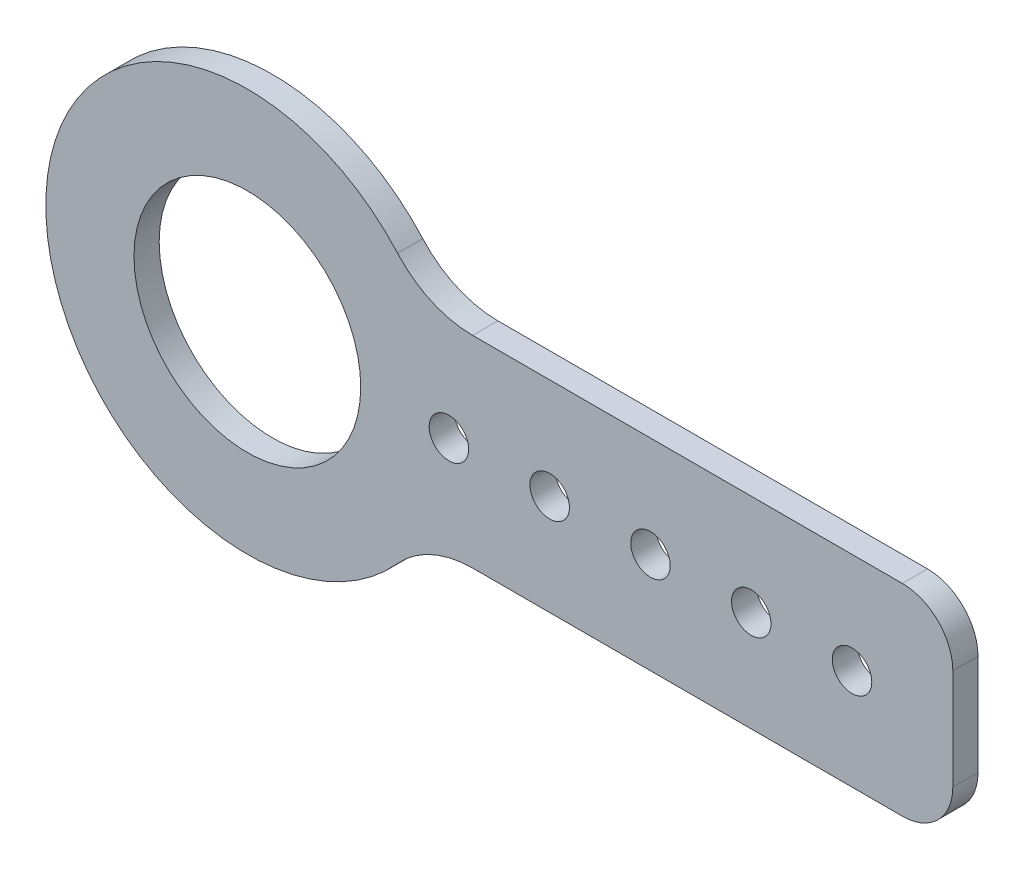
ISO-10303-21;
HEADER;
FILE_DESCRIPTION(('STEP AP214'),'2;1');
FILE_NAME('part.step','',(''),(''),'','','');
FILE_SCHEMA(('AUTOMOTIVE_DESIGN { 1 0 10303 214 1 1 1 1 }'));
ENDSEC;
DATA;
#1=APPLICATION_CONTEXT('core data for automotive mechanical design processes');
#2=APPLICATION_PROTOCOL_DEFINITION('international standard','automotive_design',2000,#1);
#3=PRODUCT_CONTEXT('',#1,'mechanical');
#4=PRODUCT('Part','Part','',(#3));
#5=PRODUCT_RELATED_PRODUCT_CATEGORY('part','',(#4));
#6=PRODUCT_DEFINITION_FORMATION('','',#4);
#7=PRODUCT_DEFINITION_CONTEXT('part definition',#1,'design');
#8=PRODUCT_DEFINITION('design','',#6,#7);
#9=PRODUCT_DEFINITION_SHAPE('','',#8);
#10=(LENGTH_UNIT() NAMED_UNIT(*) SI_UNIT(.MILLI.,.METRE.));
#11=(NAMED_UNIT(*) PLANE_ANGLE_UNIT() SI_UNIT($,.RADIAN.));
#12=(NAMED_UNIT(*) SI_UNIT($,.STERADIAN.) SOLID_ANGLE_UNIT());
#13=UNCERTAINTY_MEASURE_WITH_UNIT(LENGTH_MEASURE(1.E-05),#10,'distance_accuracy_value','');
#14=(GEOMETRIC_REPRESENTATION_CONTEXT(3) GLOBAL_UNCERTAINTY_ASSIGNED_CONTEXT((#13)) GLOBAL_UNIT_ASSIGNED_CONTEXT((#10,
#11,#12)) REPRESENTATION_CONTEXT('',''));
#15=CARTESIAN_POINT('',(0.,0.,0.));
#16=DIRECTION('',(0.,0.,1.));
#17=DIRECTION('',(1.,0.,0.));
#18=AXIS2_PLACEMENT_3D('',#15,#16,#17);
#19=CARTESIAN_POINT('',(56.7177514109584,0.,0.));
#20=DIRECTION('',(0.,0.,1.));
#21=DIRECTION('',(1.,0.,0.));
#22=AXIS2_PLACEMENT_3D('',#19,#20,#21);
#23=PLANE('',#22);
#24=CARTESIAN_POINT('',(0.,0.,0.));
#25=DIRECTION('',(0.,0.,1.));
#26=DIRECTION('',(1.,0.,0.));
#27=AXIS2_PLACEMENT_3D('',#24,#25,#26);
#28=CIRCLE('',#27,14.2875);
#29=CARTESIAN_POINT('',(14.2875,0.,0.));
#30=VERTEX_POINT('',#29);
#31=EDGE_CURVE('E142',#30,#30,#28,.T.);
#32=ORIENTED_EDGE('',*,*,#31,.T.);
#33=EDGE_LOOP('',(#32));
#34=FACE_BOUND('',#33,.T.);
#35=CARTESIAN_POINT('',(25.4,0.,0.));
#36=DIRECTION('',(0.,0.,1.));
#37=DIRECTION('',(1.,0.,0.));
#38=AXIS2_PLACEMENT_3D('',#35,#36,#37);
#39=CIRCLE('',#38,2.4892);
#40=CARTESIAN_POINT('',(27.8892,0.,0.));
#41=VERTEX_POINT('',#40);
#42=EDGE_CURVE('E145',#41,#41,#39,.T.);
#43=ORIENTED_EDGE('',*,*,#42,.T.);
#44=EDGE_LOOP('',(#43));
#45=FACE_BOUND('',#44,.T.);
#46=CARTESIAN_POINT('',(63.5,0.,0.));
#47=DIRECTION('',(0.,0.,1.));
#48=DIRECTION('',(1.,0.,0.));
#49=AXIS2_PLACEMENT_3D('',#46,#47,#48);
#50=CIRCLE('',#49,2.4892);
#51=CARTESIAN_POINT('',(65.9892,0.,0.));
#52=VERTEX_POINT('',#51);
#53=EDGE_CURVE('E148',#52,#52,#50,.T.);
#54=ORIENTED_EDGE('',*,*,#53,.T.);
#55=EDGE_LOOP('',(#54));
#56=FACE_BOUND('',#55,.T.);
#57=CARTESIAN_POINT('',(38.1,0.,0.));
#58=DIRECTION('',(0.,0.,1.));
#59=DIRECTION('',(1.,0.,0.));
#60=AXIS2_PLACEMENT_3D('',#57,#58,#59);
#61=CIRCLE('',#60,2.4892);
#62=CARTESIAN_POINT('',(40.5892,0.,0.));
#63=VERTEX_POINT('',#62);
#64=EDGE_CURVE('E151',#63,#63,#61,.T.);
#65=ORIENTED_EDGE('',*,*,#64,.T.);
#66=EDGE_LOOP('',(#65));
#67=FACE_BOUND('',#66,.T.);
#68=CARTESIAN_POINT('',(50.8,0.,0.));
#69=DIRECTION('',(0.,0.,1.));
#70=DIRECTION('',(1.,0.,0.));
#71=AXIS2_PLACEMENT_3D('',#68,#69,#70);
#72=CIRCLE('',#71,2.4892);
#73=CARTESIAN_POINT('',(53.2892,0.,0.));
#74=VERTEX_POINT('',#73);
#75=EDGE_CURVE('E100',#74,#74,#72,.T.);
#76=ORIENTED_EDGE('',*,*,#75,.T.);
#77=EDGE_LOOP('',(#76));
#78=FACE_BOUND('',#77,.T.);
#79=CARTESIAN_POINT('',(76.2,0.,0.));
#80=DIRECTION('',(0.,0.,1.));
#81=DIRECTION('',(1.,0.,0.));
#82=AXIS2_PLACEMENT_3D('',#79,#80,#81);
#83=CIRCLE('',#82,2.4892);
#84=CARTESIAN_POINT('',(78.6892,0.,0.));
#85=VERTEX_POINT('',#84);
#86=EDGE_CURVE('E97',#85,#85,#83,.T.);
#87=ORIENTED_EDGE('',*,*,#86,.T.);
#88=EDGE_LOOP('',(#87));
#89=FACE_BOUND('',#88,.T.);
#90=DIRECTION('',(1.,0.,0.));
#91=VECTOR('',#90,1.);
#92=CARTESIAN_POINT('',(21.9970452561247,-12.7,0.));
#93=LINE('',#92,#91);
#94=CARTESIAN_POINT('',(28.3980633142472,-12.7,0.));
#95=VERTEX_POINT('',#94);
#96=CARTESIAN_POINT('',(82.55,-12.7,0.));
#97=VERTEX_POINT('',#96);
#98=EDGE_CURVE('E81',#95,#97,#93,.T.);
#99=ORIENTED_EDGE('',*,*,#98,.F.);
#100=CARTESIAN_POINT('',(28.3980633142472,-25.4,0.));
#101=DIRECTION('',(0.,0.,1.));
#102=DIRECTION('',(1.,0.,0.));
#103=AXIS2_PLACEMENT_3D('',#100,#101,#102);
#104=CIRCLE('',#103,12.7);
#105=CARTESIAN_POINT('',(18.9320422094982,-16.9333333333333,0.));
#106=VERTEX_POINT('',#105);
#107=EDGE_CURVE('E94',#95,#106,#104,.T.);
#108=ORIENTED_EDGE('',*,*,#107,.T.);
#109=CARTESIAN_POINT('',(0.,0.,0.));
#110=DIRECTION('',(0.,0.,1.));
#111=DIRECTION('',(1.,0.,0.));
#112=AXIS2_PLACEMENT_3D('',#109,#110,#111);
#113=CIRCLE('',#112,25.4);
#114=CARTESIAN_POINT('',(18.9320422094983,16.9333333333333,0.));
#115=VERTEX_POINT('',#114);
#116=EDGE_CURVE('E158',#115,#106,#113,.T.);
#117=ORIENTED_EDGE('',*,*,#116,.F.);
#118=CARTESIAN_POINT('',(28.3980633142475,25.3999999999999,0.));
#119=DIRECTION('',(0.,0.,1.));
#120=DIRECTION('',(1.,0.,0.));
#121=AXIS2_PLACEMENT_3D('',#118,#119,#120);
#122=CIRCLE('',#121,12.7);
#123=CARTESIAN_POINT('',(28.3980633142475,12.7,0.));
#124=VERTEX_POINT('',#123);
#125=EDGE_CURVE('E161',#115,#124,#122,.T.);
#126=ORIENTED_EDGE('',*,*,#125,.T.);
#127=DIRECTION('',(-1.,0.,0.));
#128=VECTOR('',#127,1.);
#129=CARTESIAN_POINT('',(88.9,12.7,0.));
#130=LINE('',#129,#128);
#131=CARTESIAN_POINT('',(82.55,12.7,0.));
#132=VERTEX_POINT('',#131);
#133=EDGE_CURVE('E106',#132,#124,#130,.T.);
#134=ORIENTED_EDGE('',*,*,#133,.F.);
#135=CARTESIAN_POINT('',(82.55,6.35,0.));
#136=DIRECTION('',(0.,0.,1.));
#137=DIRECTION('',(1.,0.,0.));
#138=AXIS2_PLACEMENT_3D('',#135,#136,#137);
#139=CIRCLE('',#138,6.35);
#140=CARTESIAN_POINT('',(88.9,6.35,0.));
#141=VERTEX_POINT('',#140);
#142=EDGE_CURVE('E163',#141,#132,#139,.T.);
#143=ORIENTED_EDGE('',*,*,#142,.F.);
#144=DIRECTION('',(0.,1.,0.));
#145=VECTOR('',#144,1.);
#146=CARTESIAN_POINT('',(88.9,-12.7,0.));
#147=LINE('',#146,#145);
#148=CARTESIAN_POINT('',(88.9,-6.35,0.));
#149=VERTEX_POINT('',#148);
#150=EDGE_CURVE('E83',#149,#141,#147,.T.);
#151=ORIENTED_EDGE('',*,*,#150,.F.);
#152=CARTESIAN_POINT('',(82.55,-6.35,0.));
#153=DIRECTION('',(0.,0.,1.));
#154=DIRECTION('',(1.,0.,0.));
#155=AXIS2_PLACEMENT_3D('',#152,#153,#154);
#156=CIRCLE('',#155,6.35);
#157=EDGE_CURVE('E18',#97,#149,#156,.T.);
#158=ORIENTED_EDGE('',*,*,#157,.F.);
#159=EDGE_LOOP('',(#99,#108,#117,#126,#134,#143,#151,#158));
#160=FACE_BOUND('',#159,.T.);
#161=ADVANCED_FACE('F15',(#34,#45,#56,#67,#78,#89,#160),#23,.F.);
#162=CARTESIAN_POINT('',(82.55,-6.35,0.));
#163=DIRECTION('',(0.,0.,1.));
#164=DIRECTION('',(1.,0.,0.));
#165=AXIS2_PLACEMENT_3D('',#162,#163,#164);
#166=CYLINDRICAL_SURFACE('',#165,6.35);
#167=ORIENTED_EDGE('',*,*,#157,.T.);
#168=DIRECTION('',(0.,0.,-1.));
#169=VECTOR('',#168,1.);
#170=CARTESIAN_POINT('',(88.9,-6.35,0.));
#171=LINE('',#170,#169);
#172=CARTESIAN_POINT('',(88.9,-6.35,3.175));
#173=VERTEX_POINT('',#172);
#174=EDGE_CURVE('E86',#173,#149,#171,.T.);
#175=ORIENTED_EDGE('',*,*,#174,.F.);
#176=CARTESIAN_POINT('',(82.55,-6.35,3.175));
#177=DIRECTION('',(0.,0.,1.));
#178=DIRECTION('',(1.,0.,0.));
#179=AXIS2_PLACEMENT_3D('',#176,#177,#178);
#180=CIRCLE('',#179,6.35);
#181=CARTESIAN_POINT('',(82.55,-12.7,3.175));
#182=VERTEX_POINT('',#181);
#183=EDGE_CURVE('E91',#182,#173,#180,.T.);
#184=ORIENTED_EDGE('',*,*,#183,.F.);
#185=DIRECTION('',(0.,0.,1.));
#186=VECTOR('',#185,1.);
#187=CARTESIAN_POINT('',(82.55,-12.7,0.));
#188=LINE('',#187,#186);
#189=EDGE_CURVE('E88',#97,#182,#188,.T.);
#190=ORIENTED_EDGE('',*,*,#189,.F.);
#191=EDGE_LOOP('',(#167,#175,#184,#190));
#192=FACE_BOUND('',#191,.T.);
#193=ADVANCED_FACE('F89',(#192),#166,.T.);
#194=CARTESIAN_POINT('',(88.9,-12.7,0.));
#195=DIRECTION('',(1.,0.,0.));
#196=DIRECTION('',(0.,0.,-1.));
#197=AXIS2_PLACEMENT_3D('',#194,#195,#196);
#198=PLANE('',#197);
#199=DIRECTION('',(0.,0.,1.));
#200=VECTOR('',#199,1.);
#201=CARTESIAN_POINT('',(88.9,6.35,0.));
#202=LINE('',#201,#200);
#203=CARTESIAN_POINT('',(88.9,6.35,3.175));
#204=VERTEX_POINT('',#203);
#205=EDGE_CURVE('E110',#204,#141,#202,.F.);
#206=ORIENTED_EDGE('',*,*,#205,.F.);
#207=DIRECTION('',(0.,1.,0.));
#208=VECTOR('',#207,1.);
#209=CARTESIAN_POINT('',(88.9,0.,3.175));
#210=LINE('',#209,#208);
#211=EDGE_CURVE('E140',#173,#204,#210,.T.);
#212=ORIENTED_EDGE('',*,*,#211,.F.);
#213=ORIENTED_EDGE('',*,*,#174,.T.);
#214=ORIENTED_EDGE('',*,*,#150,.T.);
#215=EDGE_LOOP('',(#206,#212,#213,#214));
#216=FACE_BOUND('',#215,.T.);
#217=ADVANCED_FACE('F197',(#216),#198,.T.);
#218=CARTESIAN_POINT('',(82.55,6.35,0.));
#219=DIRECTION('',(0.,0.,1.));
#220=DIRECTION('',(1.,0.,0.));
#221=AXIS2_PLACEMENT_3D('',#218,#219,#220);
#222=CYLINDRICAL_SURFACE('',#221,6.35);
#223=ORIENTED_EDGE('',*,*,#142,.T.);
#224=DIRECTION('',(0.,0.,1.));
#225=VECTOR('',#224,1.);
#226=CARTESIAN_POINT('',(82.55,12.7,0.));
#227=LINE('',#226,#225);
#228=CARTESIAN_POINT('',(82.55,12.7,3.175));
#229=VERTEX_POINT('',#228);
#230=EDGE_CURVE('E109',#229,#132,#227,.F.);
#231=ORIENTED_EDGE('',*,*,#230,.F.);
#232=CARTESIAN_POINT('',(82.55,6.35,3.175));
#233=DIRECTION('',(0.,0.,1.));
#234=DIRECTION('',(1.,0.,0.));
#235=AXIS2_PLACEMENT_3D('',#232,#233,#234);
#236=CIRCLE('',#235,6.35);
#237=EDGE_CURVE('E137',#204,#229,#236,.T.);
#238=ORIENTED_EDGE('',*,*,#237,.F.);
#239=ORIENTED_EDGE('',*,*,#205,.T.);
#240=EDGE_LOOP('',(#223,#231,#238,#239));
#241=FACE_BOUND('',#240,.T.);
#242=ADVANCED_FACE('F194',(#241),#222,.T.);
#243=CARTESIAN_POINT('',(88.9,12.7,0.));
#244=DIRECTION('',(0.,1.,0.));
#245=DIRECTION('',(-1.,0.,0.));
#246=AXIS2_PLACEMENT_3D('',#243,#244,#245);
#247=PLANE('',#246);
#248=DIRECTION('',(0.,0.,1.));
#249=VECTOR('',#248,1.);
#250=CARTESIAN_POINT('',(28.3980633142475,12.6999999999999,0.));
#251=LINE('',#250,#249);
#252=CARTESIAN_POINT('',(28.3980633142475,12.7,3.175));
#253=VERTEX_POINT('',#252);
#254=EDGE_CURVE('E108',#124,#253,#251,.T.);
#255=ORIENTED_EDGE('',*,*,#254,.T.);
#256=DIRECTION('',(1.,0.,0.));
#257=VECTOR('',#256,1.);
#258=CARTESIAN_POINT('',(56.7177514109584,12.7,3.175));
#259=LINE('',#258,#257);
#260=EDGE_CURVE('E136',#229,#253,#259,.F.);
#261=ORIENTED_EDGE('',*,*,#260,.F.);
#262=ORIENTED_EDGE('',*,*,#230,.T.);
#263=ORIENTED_EDGE('',*,*,#133,.T.);
#264=EDGE_LOOP('',(#255,#261,#262,#263));
#265=FACE_BOUND('',#264,.T.);
#266=ADVANCED_FACE('F193',(#265),#247,.T.);
#267=CARTESIAN_POINT('',(28.3980633142475,25.3999999999999,0.));
#268=DIRECTION('',(0.,0.,1.));
#269=DIRECTION('',(1.,0.,0.));
#270=AXIS2_PLACEMENT_3D('',#267,#268,#269);
#271=CYLINDRICAL_SURFACE('',#270,12.7);
#272=DIRECTION('',(0.,0.,1.));
#273=VECTOR('',#272,1.);
#274=CARTESIAN_POINT('',(18.9320422094982,16.9333333333333,0.));
#275=LINE('',#274,#273);
#276=CARTESIAN_POINT('',(18.9320422094983,16.9333333333333,3.175));
#277=VERTEX_POINT('',#276);
#278=EDGE_CURVE('E160',#277,#115,#275,.F.);
#279=ORIENTED_EDGE('',*,*,#278,.F.);
#280=CARTESIAN_POINT('',(28.3980633142475,25.3999999999999,3.175));
#281=DIRECTION('',(0.,0.,1.));
#282=DIRECTION('',(1.,0.,0.));
#283=AXIS2_PLACEMENT_3D('',#280,#281,#282);
#284=CIRCLE('',#283,12.7);
#285=EDGE_CURVE('E133',#253,#277,#284,.F.);
#286=ORIENTED_EDGE('',*,*,#285,.F.);
#287=ORIENTED_EDGE('',*,*,#254,.F.);
#288=ORIENTED_EDGE('',*,*,#125,.F.);
#289=EDGE_LOOP('',(#279,#286,#287,#288));
#290=FACE_BOUND('',#289,.T.);
#291=ADVANCED_FACE('F190',(#290),#271,.F.);
#292=CARTESIAN_POINT('',(0.,0.,0.));
#293=DIRECTION('',(0.,0.,1.));
#294=DIRECTION('',(1.,0.,0.));
#295=AXIS2_PLACEMENT_3D('',#292,#293,#294);
#296=CYLINDRICAL_SURFACE('',#295,25.4);
#297=ORIENTED_EDGE('',*,*,#278,.T.);
#298=ORIENTED_EDGE('',*,*,#116,.T.);
#299=DIRECTION('',(0.,0.,1.));
#300=VECTOR('',#299,1.);
#301=CARTESIAN_POINT('',(18.9320422094981,-16.9333333333333,0.));
#302=LINE('',#301,#300);
#303=CARTESIAN_POINT('',(18.9320422094981,-16.9333333333333,3.175));
#304=VERTEX_POINT('',#303);
#305=EDGE_CURVE('E157',#106,#304,#302,.T.);
#306=ORIENTED_EDGE('',*,*,#305,.T.);
#307=CARTESIAN_POINT('',(0.,0.,3.175));
#308=DIRECTION('',(0.,0.,1.));
#309=DIRECTION('',(1.,0.,0.));
#310=AXIS2_PLACEMENT_3D('',#307,#308,#309);
#311=CIRCLE('',#310,25.4);
#312=EDGE_CURVE('E130',#277,#304,#311,.T.);
#313=ORIENTED_EDGE('',*,*,#312,.F.);
#314=EDGE_LOOP('',(#297,#298,#306,#313));
#315=FACE_BOUND('',#314,.T.);
#316=ADVANCED_FACE('F185',(#315),#296,.T.);
#317=CARTESIAN_POINT('',(28.3980633142472,-25.4,0.));
#318=DIRECTION('',(0.,0.,1.));
#319=DIRECTION('',(1.,0.,0.));
#320=AXIS2_PLACEMENT_3D('',#317,#318,#319);
#321=CYLINDRICAL_SURFACE('',#320,12.7);
#322=DIRECTION('',(0.,0.,1.));
#323=VECTOR('',#322,1.);
#324=CARTESIAN_POINT('',(28.3980633142472,-12.7,0.));
#325=LINE('',#324,#323);
#326=CARTESIAN_POINT('',(28.3980633142472,-12.7,3.175));
#327=VERTEX_POINT('',#326);
#328=EDGE_CURVE('E33',#327,#95,#325,.F.);
#329=ORIENTED_EDGE('',*,*,#328,.F.);
#330=CARTESIAN_POINT('',(28.3980633142472,-25.4,3.175));
#331=DIRECTION('',(0.,0.,1.));
#332=DIRECTION('',(1.,0.,0.));
#333=AXIS2_PLACEMENT_3D('',#330,#331,#332);
#334=CIRCLE('',#333,12.7);
#335=EDGE_CURVE('E127',#304,#327,#334,.F.);
#336=ORIENTED_EDGE('',*,*,#335,.F.);
#337=ORIENTED_EDGE('',*,*,#305,.F.);
#338=ORIENTED_EDGE('',*,*,#107,.F.);
#339=EDGE_LOOP('',(#329,#336,#337,#338));
#340=FACE_BOUND('',#339,.T.);
#341=ADVANCED_FACE('F183',(#340),#321,.F.);
#342=CARTESIAN_POINT('',(21.9970452561247,-12.7,0.));
#343=DIRECTION('',(0.,-1.,0.));
#344=DIRECTION('',(1.,0.,0.));
#345=AXIS2_PLACEMENT_3D('',#342,#343,#344);
#346=PLANE('',#345);
#347=ORIENTED_EDGE('',*,*,#328,.T.);
#348=ORIENTED_EDGE('',*,*,#98,.T.);
#349=ORIENTED_EDGE('',*,*,#189,.T.);
#350=DIRECTION('',(1.,0.,0.));
#351=VECTOR('',#350,1.);
#352=CARTESIAN_POINT('',(56.7177514109584,-12.7,3.175));
#353=LINE('',#352,#351);
#354=EDGE_CURVE('E126',#327,#182,#353,.T.);
#355=ORIENTED_EDGE('',*,*,#354,.F.);
#356=EDGE_LOOP('',(#347,#348,#349,#355));
#357=FACE_BOUND('',#356,.T.);
#358=ADVANCED_FACE('F96',(#357),#346,.T.);
#359=CARTESIAN_POINT('',(76.2,0.,125.120784144762));
#360=DIRECTION('',(0.,0.,1.));
#361=DIRECTION('',(1.,0.,0.));
#362=AXIS2_PLACEMENT_3D('',#359,#360,#361);
#363=CYLINDRICAL_SURFACE('',#362,2.4892);
#364=ORIENTED_EDGE('',*,*,#86,.F.);
#365=EDGE_LOOP('',(#364));
#366=FACE_BOUND('',#365,.T.);
#367=CARTESIAN_POINT('',(76.2,0.,3.175));
#368=DIRECTION('',(0.,0.,1.));
#369=DIRECTION('',(1.,0.,0.));
#370=AXIS2_PLACEMENT_3D('',#367,#368,#369);
#371=CIRCLE('',#370,2.4892);
#372=CARTESIAN_POINT('',(78.6892,0.,3.175));
#373=VERTEX_POINT('',#372);
#374=EDGE_CURVE('E123',#373,#373,#371,.F.);
#375=ORIENTED_EDGE('',*,*,#374,.F.);
#376=EDGE_LOOP('',(#375));
#377=FACE_BOUND('',#376,.T.);
#378=ADVANCED_FACE('F232',(#366,#377),#363,.F.);
#379=CARTESIAN_POINT('',(50.8,0.,125.120784144762));
#380=DIRECTION('',(0.,0.,1.));
#381=DIRECTION('',(1.,0.,0.));
#382=AXIS2_PLACEMENT_3D('',#379,#380,#381);
#383=CYLINDRICAL_SURFACE('',#382,2.4892);
#384=ORIENTED_EDGE('',*,*,#75,.F.);
#385=EDGE_LOOP('',(#384));
#386=FACE_BOUND('',#385,.T.);
#387=CARTESIAN_POINT('',(50.8,0.,3.175));
#388=DIRECTION('',(0.,0.,1.));
#389=DIRECTION('',(1.,0.,0.));
#390=AXIS2_PLACEMENT_3D('',#387,#388,#389);
#391=CIRCLE('',#390,2.4892);
#392=CARTESIAN_POINT('',(53.2892,0.,3.175));
#393=VERTEX_POINT('',#392);
#394=EDGE_CURVE('E120',#393,#393,#391,.F.);
#395=ORIENTED_EDGE('',*,*,#394,.F.);
#396=EDGE_LOOP('',(#395));
#397=FACE_BOUND('',#396,.T.);
#398=ADVANCED_FACE('F228',(#386,#397),#383,.F.);
#399=CARTESIAN_POINT('',(38.1,0.,125.120784144762));
#400=DIRECTION('',(0.,0.,1.));
#401=DIRECTION('',(1.,0.,0.));
#402=AXIS2_PLACEMENT_3D('',#399,#400,#401);
#403=CYLINDRICAL_SURFACE('',#402,2.4892);
#404=ORIENTED_EDGE('',*,*,#64,.F.);
#405=EDGE_LOOP('',(#404));
#406=FACE_BOUND('',#405,.T.);
#407=CARTESIAN_POINT('',(38.1,0.,3.175));
#408=DIRECTION('',(0.,0.,1.));
#409=DIRECTION('',(1.,0.,0.));
#410=AXIS2_PLACEMENT_3D('',#407,#408,#409);
#411=CIRCLE('',#410,2.4892);
#412=CARTESIAN_POINT('',(40.5892,0.,3.175));
#413=VERTEX_POINT('',#412);
#414=EDGE_CURVE('E117',#413,#413,#411,.F.);
#415=ORIENTED_EDGE('',*,*,#414,.F.);
#416=EDGE_LOOP('',(#415));
#417=FACE_BOUND('',#416,.T.);
#418=ADVANCED_FACE('F224',(#406,#417),#403,.F.);
#419=CARTESIAN_POINT('',(63.5,0.,125.120784144762));
#420=DIRECTION('',(0.,0.,1.));
#421=DIRECTION('',(1.,0.,0.));
#422=AXIS2_PLACEMENT_3D('',#419,#420,#421);
#423=CYLINDRICAL_SURFACE('',#422,2.4892);
#424=ORIENTED_EDGE('',*,*,#53,.F.);
#425=EDGE_LOOP('',(#424));
#426=FACE_BOUND('',#425,.T.);
#427=CARTESIAN_POINT('',(63.5,0.,3.175));
#428=DIRECTION('',(0.,0.,1.));
#429=DIRECTION('',(1.,0.,0.));
#430=AXIS2_PLACEMENT_3D('',#427,#428,#429);
#431=CIRCLE('',#430,2.4892);
#432=CARTESIAN_POINT('',(65.9892,0.,3.175));
#433=VERTEX_POINT('',#432);
#434=EDGE_CURVE('E114',#433,#433,#431,.F.);
#435=ORIENTED_EDGE('',*,*,#434,.F.);
#436=EDGE_LOOP('',(#435));
#437=FACE_BOUND('',#436,.T.);
#438=ADVANCED_FACE('F220',(#426,#437),#423,.F.);
#439=CARTESIAN_POINT('',(25.4,0.,125.120784144762));
#440=DIRECTION('',(0.,0.,1.));
#441=DIRECTION('',(1.,0.,0.));
#442=AXIS2_PLACEMENT_3D('',#439,#440,#441);
#443=CYLINDRICAL_SURFACE('',#442,2.4892);
#444=ORIENTED_EDGE('',*,*,#42,.F.);
#445=EDGE_LOOP('',(#444));
#446=FACE_BOUND('',#445,.T.);
#447=CARTESIAN_POINT('',(25.4,0.,3.175));
#448=DIRECTION('',(0.,0.,1.));
#449=DIRECTION('',(1.,0.,0.));
#450=AXIS2_PLACEMENT_3D('',#447,#448,#449);
#451=CIRCLE('',#450,2.4892);
#452=CARTESIAN_POINT('',(27.8892,0.,3.175));
#453=VERTEX_POINT('',#452);
#454=EDGE_CURVE('E24',#453,#453,#451,.F.);
#455=ORIENTED_EDGE('',*,*,#454,.F.);
#456=EDGE_LOOP('',(#455));
#457=FACE_BOUND('',#456,.T.);
#458=ADVANCED_FACE('F213',(#446,#457),#443,.F.);
#459=CARTESIAN_POINT('',(0.,0.,0.));
#460=DIRECTION('',(0.,0.,1.));
#461=DIRECTION('',(1.,0.,0.));
#462=AXIS2_PLACEMENT_3D('',#459,#460,#461);
#463=CYLINDRICAL_SURFACE('',#462,14.2875);
#464=ORIENTED_EDGE('',*,*,#31,.F.);
#465=EDGE_LOOP('',(#464));
#466=FACE_BOUND('',#465,.T.);
#467=CARTESIAN_POINT('',(0.,0.,3.175));
#468=DIRECTION('',(0.,0.,1.));
#469=DIRECTION('',(1.,0.,0.));
#470=AXIS2_PLACEMENT_3D('',#467,#468,#469);
#471=CIRCLE('',#470,14.2875);
#472=CARTESIAN_POINT('',(14.2875,0.,3.175));
#473=VERTEX_POINT('',#472);
#474=EDGE_CURVE('E9',#473,#473,#471,.F.);
#475=ORIENTED_EDGE('',*,*,#474,.F.);
#476=EDGE_LOOP('',(#475));
#477=FACE_BOUND('',#476,.T.);
#478=ADVANCED_FACE('F207',(#466,#477),#463,.F.);
#479=CARTESIAN_POINT('',(56.7177514109584,0.,3.175));
#480=DIRECTION('',(0.,0.,1.));
#481=DIRECTION('',(1.,0.,0.));
#482=AXIS2_PLACEMENT_3D('',#479,#480,#481);
#483=PLANE('',#482);
#484=ORIENTED_EDGE('',*,*,#474,.T.);
#485=EDGE_LOOP('',(#484));
#486=FACE_BOUND('',#485,.T.);
#487=ORIENTED_EDGE('',*,*,#454,.T.);
#488=EDGE_LOOP('',(#487));
#489=FACE_BOUND('',#488,.T.);
#490=ORIENTED_EDGE('',*,*,#434,.T.);
#491=EDGE_LOOP('',(#490));
#492=FACE_BOUND('',#491,.T.);
#493=ORIENTED_EDGE('',*,*,#414,.T.);
#494=EDGE_LOOP('',(#493));
#495=FACE_BOUND('',#494,.T.);
#496=ORIENTED_EDGE('',*,*,#394,.T.);
#497=EDGE_LOOP('',(#496));
#498=FACE_BOUND('',#497,.T.);
#499=ORIENTED_EDGE('',*,*,#374,.T.);
#500=EDGE_LOOP('',(#499));
#501=FACE_BOUND('',#500,.T.);
#502=ORIENTED_EDGE('',*,*,#335,.T.);
#503=ORIENTED_EDGE('',*,*,#354,.T.);
#504=ORIENTED_EDGE('',*,*,#183,.T.);
#505=ORIENTED_EDGE('',*,*,#211,.T.);
#506=ORIENTED_EDGE('',*,*,#237,.T.);
#507=ORIENTED_EDGE('',*,*,#260,.T.);
#508=ORIENTED_EDGE('',*,*,#285,.T.);
#509=ORIENTED_EDGE('',*,*,#312,.T.);
#510=EDGE_LOOP('',(#502,#503,#504,#505,#506,#507,#508,#509));
#511=FACE_BOUND('',#510,.T.);
#512=ADVANCED_FACE('F180',(#486,#489,#492,#495,#498,#501,#511),#483,.T.);
#513=CLOSED_SHELL('',(#161,#193,#217,#242,#266,#291,#316,#341,#358,#378,#398,#418,#438,#458,
#478,#512));
#514=MANIFOLD_SOLID_BREP('B1',#513);
#515=ADVANCED_BREP_SHAPE_REPRESENTATION('',(#18,#514),#14);
#516=SHAPE_DEFINITION_REPRESENTATION(#9,#515);
ENDSEC;
END-ISO-10303-21;
